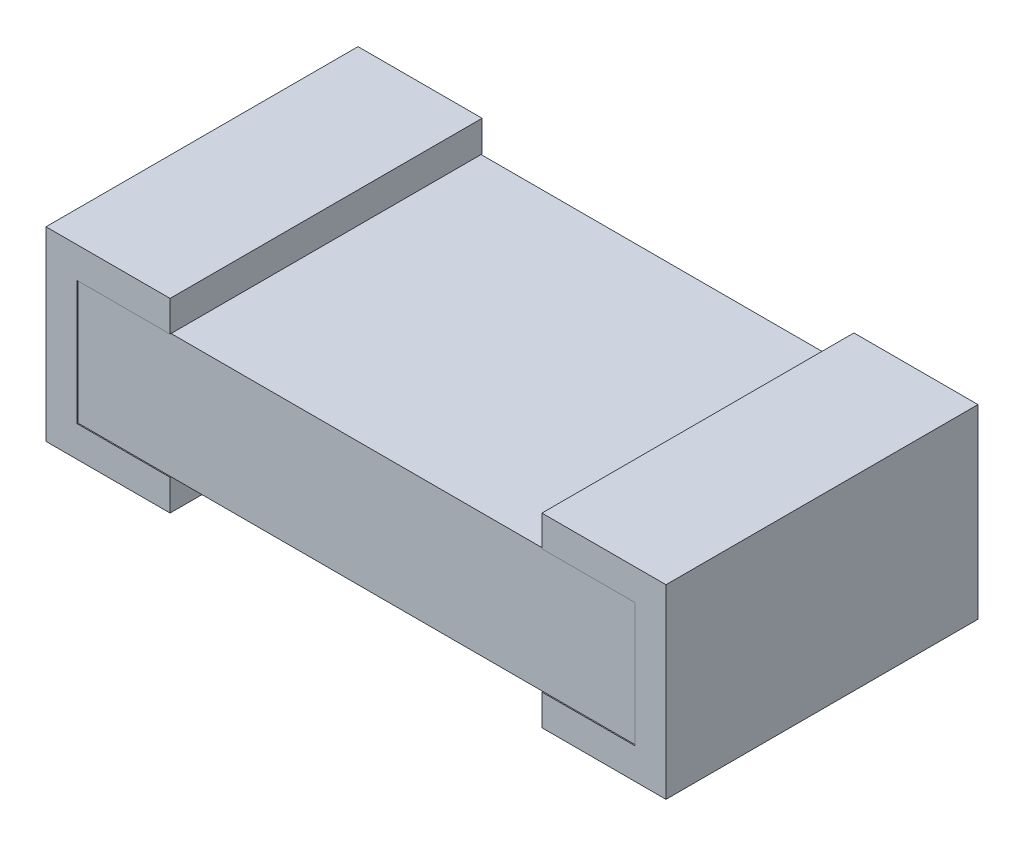
ISO-10303-21;
HEADER;
FILE_DESCRIPTION(('STEP AP214'),'2;1');
FILE_NAME('part.step','',(''),(''),'','','');
FILE_SCHEMA(('AUTOMOTIVE_DESIGN { 1 0 10303 214 1 1 1 1 }'));
ENDSEC;
DATA;
#1=APPLICATION_CONTEXT('core data for automotive mechanical design processes');
#2=APPLICATION_PROTOCOL_DEFINITION('international standard','automotive_design',2000,#1);
#3=PRODUCT_CONTEXT('',#1,'mechanical');
#4=PRODUCT('Part','Part','',(#3));
#5=PRODUCT_RELATED_PRODUCT_CATEGORY('part','',(#4));
#6=PRODUCT_DEFINITION_FORMATION('','',#4);
#7=PRODUCT_DEFINITION_CONTEXT('part definition',#1,'design');
#8=PRODUCT_DEFINITION('design','',#6,#7);
#9=PRODUCT_DEFINITION_SHAPE('','',#8);
#10=(LENGTH_UNIT() NAMED_UNIT(*) SI_UNIT(.MILLI.,.METRE.));
#11=(NAMED_UNIT(*) PLANE_ANGLE_UNIT() SI_UNIT($,.RADIAN.));
#12=(NAMED_UNIT(*) SI_UNIT($,.STERADIAN.) SOLID_ANGLE_UNIT());
#13=UNCERTAINTY_MEASURE_WITH_UNIT(LENGTH_MEASURE(1.E-05),#10,'distance_accuracy_value','');
#14=(GEOMETRIC_REPRESENTATION_CONTEXT(3) GLOBAL_UNCERTAINTY_ASSIGNED_CONTEXT((#13)) GLOBAL_UNIT_ASSIGNED_CONTEXT((#10,
#11,#12)) REPRESENTATION_CONTEXT('',''));
#15=CARTESIAN_POINT('',(0.,0.,0.));
#16=DIRECTION('',(0.,0.,1.));
#17=DIRECTION('',(1.,0.,0.));
#18=AXIS2_PLACEMENT_3D('',#15,#16,#17);
#19=CARTESIAN_POINT('',(-0.686,0.1525,0.381));
#20=DIRECTION('',(0.,-1.,0.));
#21=DIRECTION('',(0.,0.,-1.));
#22=AXIS2_PLACEMENT_3D('',#19,#20,#21);
#23=PLANE('',#22);
#24=DIRECTION('',(-1.,0.,0.));
#25=VECTOR('',#24,1.);
#26=CARTESIAN_POINT('',(-0.686,0.1525,0.381));
#27=LINE('',#26,#25);
#28=CARTESIAN_POINT('',(0.457,0.1525,0.381));
#29=VERTEX_POINT('',#28);
#30=CARTESIAN_POINT('',(-0.457,0.1525,0.381));
#31=VERTEX_POINT('',#30);
#32=EDGE_CURVE('E56',#29,#31,#27,.T.);
#33=ORIENTED_EDGE('',*,*,#32,.F.);
#34=DIRECTION('',(0.,0.,-1.));
#35=VECTOR('',#34,1.);
#36=CARTESIAN_POINT('',(0.457,0.1525,0.3835));
#37=LINE('',#36,#35);
#38=CARTESIAN_POINT('',(0.457,0.1525,-0.381));
#39=VERTEX_POINT('',#38);
#40=EDGE_CURVE('E203',#29,#39,#37,.T.);
#41=ORIENTED_EDGE('',*,*,#40,.T.);
#42=DIRECTION('',(-1.,0.,0.));
#43=VECTOR('',#42,1.);
#44=CARTESIAN_POINT('',(-0.686,0.1525,-0.381));
#45=LINE('',#44,#43);
#46=CARTESIAN_POINT('',(-0.457,0.1525,-0.381));
#47=VERTEX_POINT('',#46);
#48=EDGE_CURVE('E367',#39,#47,#45,.T.);
#49=ORIENTED_EDGE('',*,*,#48,.T.);
#50=DIRECTION('',(0.,0.,-1.));
#51=VECTOR('',#50,1.);
#52=CARTESIAN_POINT('',(-0.457,0.1525,0.3835));
#53=LINE('',#52,#51);
#54=EDGE_CURVE('E326',#31,#47,#53,.T.);
#55=ORIENTED_EDGE('',*,*,#54,.F.);
#56=EDGE_LOOP('',(#33,#41,#49,#55));
#57=FACE_BOUND('',#56,.T.);
#58=ADVANCED_FACE('F32',(#57),#23,.F.);
#59=CARTESIAN_POINT('',(-0.686,-0.1525,0.381));
#60=DIRECTION('',(0.,1.,0.));
#61=DIRECTION('',(0.,0.,1.));
#62=AXIS2_PLACEMENT_3D('',#59,#60,#61);
#63=PLANE('',#62);
#64=DIRECTION('',(1.,0.,0.));
#65=VECTOR('',#64,1.);
#66=CARTESIAN_POINT('',(-0.686,-0.1525,-0.381));
#67=LINE('',#66,#65);
#68=CARTESIAN_POINT('',(-0.457,-0.1525,-0.381));
#69=VERTEX_POINT('',#68);
#70=CARTESIAN_POINT('',(0.457,-0.1525,-0.381));
#71=VERTEX_POINT('',#70);
#72=EDGE_CURVE('E374',#69,#71,#67,.T.);
#73=ORIENTED_EDGE('',*,*,#72,.T.);
#74=DIRECTION('',(0.,0.,-1.));
#75=VECTOR('',#74,1.);
#76=CARTESIAN_POINT('',(0.457,-0.1525,0.3835));
#77=LINE('',#76,#75);
#78=CARTESIAN_POINT('',(0.457,-0.1525,0.381));
#79=VERTEX_POINT('',#78);
#80=EDGE_CURVE('E48',#79,#71,#77,.T.);
#81=ORIENTED_EDGE('',*,*,#80,.F.);
#82=DIRECTION('',(1.,0.,0.));
#83=VECTOR('',#82,1.);
#84=CARTESIAN_POINT('',(-0.686,-0.1525,0.381));
#85=LINE('',#84,#83);
#86=CARTESIAN_POINT('',(-0.457,-0.1525,0.381));
#87=VERTEX_POINT('',#86);
#88=EDGE_CURVE('E40',#87,#79,#85,.T.);
#89=ORIENTED_EDGE('',*,*,#88,.F.);
#90=DIRECTION('',(0.,0.,-1.));
#91=VECTOR('',#90,1.);
#92=CARTESIAN_POINT('',(-0.457,-0.1525,0.3835));
#93=LINE('',#92,#91);
#94=EDGE_CURVE('E339',#87,#69,#93,.T.);
#95=ORIENTED_EDGE('',*,*,#94,.T.);
#96=EDGE_LOOP('',(#73,#81,#89,#95));
#97=FACE_BOUND('',#96,.T.);
#98=ADVANCED_FACE('F390',(#97),#63,.F.);
#99=CARTESIAN_POINT('',(0.686,0.1525,0.381));
#100=DIRECTION('',(0.,0.,-1.));
#101=DIRECTION('',(-1.,0.,0.));
#102=AXIS2_PLACEMENT_3D('',#99,#100,#101);
#103=PLANE('',#102);
#104=DIRECTION('',(0.,1.,0.));
#105=VECTOR('',#104,1.);
#106=CARTESIAN_POINT('',(0.686,-0.1525,0.381));
#107=LINE('',#106,#105);
#108=CARTESIAN_POINT('',(0.686,-0.1525,0.381));
#109=VERTEX_POINT('',#108);
#110=CARTESIAN_POINT('',(0.686,0.1525,0.381));
#111=VERTEX_POINT('',#110);
#112=EDGE_CURVE('E355',#109,#111,#107,.T.);
#113=ORIENTED_EDGE('',*,*,#112,.T.);
#114=EDGE_CURVE('E357',#111,#29,#27,.T.);
#115=ORIENTED_EDGE('',*,*,#114,.T.);
#116=ORIENTED_EDGE('',*,*,#32,.T.);
#117=DIRECTION('',(1.,0.,0.));
#118=VECTOR('',#117,1.);
#119=CARTESIAN_POINT('',(0.686,0.1525,0.381));
#120=LINE('',#119,#118);
#121=CARTESIAN_POINT('',(-0.686,0.1525,0.381));
#122=VERTEX_POINT('',#121);
#123=EDGE_CURVE('E351',#122,#31,#120,.T.);
#124=ORIENTED_EDGE('',*,*,#123,.F.);
#125=DIRECTION('',(0.,-1.,0.));
#126=VECTOR('',#125,1.);
#127=CARTESIAN_POINT('',(-0.686,-0.1525,0.381));
#128=LINE('',#127,#126);
#129=CARTESIAN_POINT('',(-0.686,-0.1525,0.381));
#130=VERTEX_POINT('',#129);
#131=EDGE_CURVE('E359',#122,#130,#128,.T.);
#132=ORIENTED_EDGE('',*,*,#131,.T.);
#133=EDGE_CURVE('E11',#130,#87,#85,.T.);
#134=ORIENTED_EDGE('',*,*,#133,.T.);
#135=ORIENTED_EDGE('',*,*,#88,.T.);
#136=DIRECTION('',(1.,0.,0.));
#137=VECTOR('',#136,1.);
#138=CARTESIAN_POINT('',(0.686,-0.1525,0.381));
#139=LINE('',#138,#137);
#140=EDGE_CURVE('E207',#79,#109,#139,.T.);
#141=ORIENTED_EDGE('',*,*,#140,.T.);
#142=EDGE_LOOP('',(#113,#115,#116,#124,#132,#134,#135,#141));
#143=FACE_BOUND('',#142,.T.);
#144=ADVANCED_FACE('F417',(#143),#103,.F.);
#145=CARTESIAN_POINT('',(0.686,0.1525,-0.381));
#146=DIRECTION('',(0.,0.,-1.));
#147=DIRECTION('',(-1.,0.,0.));
#148=AXIS2_PLACEMENT_3D('',#145,#146,#147);
#149=PLANE('',#148);
#150=DIRECTION('',(0.,1.,0.));
#151=VECTOR('',#150,1.);
#152=CARTESIAN_POINT('',(0.686,-0.1525,-0.381));
#153=LINE('',#152,#151);
#154=CARTESIAN_POINT('',(0.686,-0.1525,-0.381));
#155=VERTEX_POINT('',#154);
#156=CARTESIAN_POINT('',(0.686,0.1525,-0.381));
#157=VERTEX_POINT('',#156);
#158=EDGE_CURVE('E354',#155,#157,#153,.T.);
#159=ORIENTED_EDGE('',*,*,#158,.F.);
#160=EDGE_CURVE('E369',#71,#155,#67,.T.);
#161=ORIENTED_EDGE('',*,*,#160,.F.);
#162=ORIENTED_EDGE('',*,*,#72,.F.);
#163=CARTESIAN_POINT('',(-0.686,-0.1525,-0.381));
#164=VERTEX_POINT('',#163);
#165=EDGE_CURVE('E35',#164,#69,#67,.T.);
#166=ORIENTED_EDGE('',*,*,#165,.F.);
#167=DIRECTION('',(0.,-1.,0.));
#168=VECTOR('',#167,1.);
#169=CARTESIAN_POINT('',(-0.686,-0.1525,-0.381));
#170=LINE('',#169,#168);
#171=CARTESIAN_POINT('',(-0.686,0.1525,-0.381));
#172=VERTEX_POINT('',#171);
#173=EDGE_CURVE('E366',#172,#164,#170,.T.);
#174=ORIENTED_EDGE('',*,*,#173,.F.);
#175=EDGE_CURVE('E363',#47,#172,#45,.T.);
#176=ORIENTED_EDGE('',*,*,#175,.F.);
#177=ORIENTED_EDGE('',*,*,#48,.F.);
#178=EDGE_CURVE('E364',#157,#39,#45,.T.);
#179=ORIENTED_EDGE('',*,*,#178,.F.);
#180=EDGE_LOOP('',(#159,#161,#162,#166,#174,#176,#177,#179));
#181=FACE_BOUND('',#180,.T.);
#182=ADVANCED_FACE('F391',(#181),#149,.T.);
#183=CARTESIAN_POINT('',(-0.686,-0.1525,0.3835));
#184=DIRECTION('',(0.,-1.,0.));
#185=DIRECTION('',(0.,0.,-1.));
#186=AXIS2_PLACEMENT_3D('',#183,#184,#185);
#187=PLANE('',#186);
#188=CARTESIAN_POINT('',(-0.457,-0.1525,0.3835));
#189=VERTEX_POINT('',#188);
#190=EDGE_CURVE('E335',#189,#87,#93,.T.);
#191=ORIENTED_EDGE('',*,*,#190,.T.);
#192=ORIENTED_EDGE('',*,*,#133,.F.);
#193=DIRECTION('',(0.,0.,-1.));
#194=VECTOR('',#193,1.);
#195=CARTESIAN_POINT('',(-0.686,-0.1525,0.3835));
#196=LINE('',#195,#194);
#197=CARTESIAN_POINT('',(-0.686,-0.1525,0.3835));
#198=VERTEX_POINT('',#197);
#199=EDGE_CURVE('E331',#198,#130,#196,.T.);
#200=ORIENTED_EDGE('',*,*,#199,.F.);
#201=DIRECTION('',(-1.,0.,0.));
#202=VECTOR('',#201,1.);
#203=CARTESIAN_POINT('',(-0.686,-0.1525,0.3835));
#204=LINE('',#203,#202);
#205=EDGE_CURVE('E296',#189,#198,#204,.T.);
#206=ORIENTED_EDGE('',*,*,#205,.F.);
#207=EDGE_LOOP('',(#191,#192,#200,#206));
#208=FACE_BOUND('',#207,.T.);
#209=ADVANCED_FACE('F422',(#208),#187,.F.);
#210=CARTESIAN_POINT('',(-0.686,0.1525,0.3835));
#211=DIRECTION('',(-1.,0.,0.));
#212=DIRECTION('',(0.,0.,1.));
#213=AXIS2_PLACEMENT_3D('',#210,#211,#212);
#214=PLANE('',#213);
#215=ORIENTED_EDGE('',*,*,#199,.T.);
#216=ORIENTED_EDGE('',*,*,#131,.F.);
#217=DIRECTION('',(0.,0.,-1.));
#218=VECTOR('',#217,1.);
#219=CARTESIAN_POINT('',(-0.686,0.1525,0.3835));
#220=LINE('',#219,#218);
#221=CARTESIAN_POINT('',(-0.686,0.1525,0.3835));
#222=VERTEX_POINT('',#221);
#223=EDGE_CURVE('E327',#222,#122,#220,.T.);
#224=ORIENTED_EDGE('',*,*,#223,.F.);
#225=DIRECTION('',(0.,1.,0.));
#226=VECTOR('',#225,1.);
#227=CARTESIAN_POINT('',(-0.686,0.1525,0.3835));
#228=LINE('',#227,#226);
#229=EDGE_CURVE('E298',#198,#222,#228,.T.);
#230=ORIENTED_EDGE('',*,*,#229,.F.);
#231=EDGE_LOOP('',(#215,#216,#224,#230));
#232=FACE_BOUND('',#231,.T.);
#233=ADVANCED_FACE('F426',(#232),#214,.F.);
#234=CARTESIAN_POINT('',(-0.457,0.1525,0.3835));
#235=DIRECTION('',(0.,1.,0.));
#236=DIRECTION('',(0.,0.,1.));
#237=AXIS2_PLACEMENT_3D('',#234,#235,#236);
#238=PLANE('',#237);
#239=ORIENTED_EDGE('',*,*,#223,.T.);
#240=ORIENTED_EDGE('',*,*,#123,.T.);
#241=CARTESIAN_POINT('',(-0.457,0.1525,0.3835));
#242=VERTEX_POINT('',#241);
#243=EDGE_CURVE('E322',#242,#31,#53,.T.);
#244=ORIENTED_EDGE('',*,*,#243,.F.);
#245=DIRECTION('',(1.,0.,0.));
#246=VECTOR('',#245,1.);
#247=CARTESIAN_POINT('',(-0.457,0.1525,0.3835));
#248=LINE('',#247,#246);
#249=EDGE_CURVE('E300',#222,#242,#248,.T.);
#250=ORIENTED_EDGE('',*,*,#249,.F.);
#251=EDGE_LOOP('',(#239,#240,#244,#250));
#252=FACE_BOUND('',#251,.T.);
#253=ADVANCED_FACE('F452',(#252),#238,.F.);
#254=CARTESIAN_POINT('',(-0.457,0.2285,0.3835));
#255=DIRECTION('',(-1.,0.,0.));
#256=DIRECTION('',(0.,-1.,0.));
#257=AXIS2_PLACEMENT_3D('',#254,#255,#256);
#258=PLANE('',#257);
#259=DIRECTION('',(0.,1.,0.));
#260=VECTOR('',#259,1.);
#261=CARTESIAN_POINT('',(-0.457,0.2285,-0.3835));
#262=LINE('',#261,#260);
#263=CARTESIAN_POINT('',(-0.457,0.1525,-0.3835));
#264=VERTEX_POINT('',#263);
#265=CARTESIAN_POINT('',(-0.457,0.2285,-0.3835));
#266=VERTEX_POINT('',#265);
#267=EDGE_CURVE('E283',#264,#266,#262,.T.);
#268=ORIENTED_EDGE('',*,*,#267,.T.);
#269=DIRECTION('',(0.,0.,-1.));
#270=VECTOR('',#269,1.);
#271=CARTESIAN_POINT('',(-0.457,0.2285,0.3835));
#272=LINE('',#271,#270);
#273=CARTESIAN_POINT('',(-0.457,0.2285,0.3835));
#274=VERTEX_POINT('',#273);
#275=EDGE_CURVE('E348',#274,#266,#272,.T.);
#276=ORIENTED_EDGE('',*,*,#275,.F.);
#277=DIRECTION('',(0.,1.,0.));
#278=VECTOR('',#277,1.);
#279=CARTESIAN_POINT('',(-0.457,0.2285,0.3835));
#280=LINE('',#279,#278);
#281=EDGE_CURVE('E284',#242,#274,#280,.T.);
#282=ORIENTED_EDGE('',*,*,#281,.F.);
#283=ORIENTED_EDGE('',*,*,#243,.T.);
#284=ORIENTED_EDGE('',*,*,#54,.T.);
#285=EDGE_CURVE('E302',#47,#264,#53,.T.);
#286=ORIENTED_EDGE('',*,*,#285,.T.);
#287=EDGE_LOOP('',(#268,#276,#282,#283,#284,#286));
#288=FACE_BOUND('',#287,.T.);
#289=ADVANCED_FACE('F454',(#288),#258,.F.);
#290=CARTESIAN_POINT('',(-0.762,0.2285,0.3835));
#291=DIRECTION('',(0.,-1.,0.));
#292=DIRECTION('',(0.,0.,-1.));
#293=AXIS2_PLACEMENT_3D('',#290,#291,#292);
#294=PLANE('',#293);
#295=DIRECTION('',(-1.,0.,0.));
#296=VECTOR('',#295,1.);
#297=CARTESIAN_POINT('',(-0.762,0.2285,-0.3835));
#298=LINE('',#297,#296);
#299=CARTESIAN_POINT('',(-0.762,0.2285,-0.3835));
#300=VERTEX_POINT('',#299);
#301=EDGE_CURVE('E305',#266,#300,#298,.T.);
#302=ORIENTED_EDGE('',*,*,#301,.T.);
#303=DIRECTION('',(0.,0.,-1.));
#304=VECTOR('',#303,1.);
#305=CARTESIAN_POINT('',(-0.762,0.2285,0.3835));
#306=LINE('',#305,#304);
#307=CARTESIAN_POINT('',(-0.762,0.2285,0.3835));
#308=VERTEX_POINT('',#307);
#309=EDGE_CURVE('E345',#308,#300,#306,.T.);
#310=ORIENTED_EDGE('',*,*,#309,.F.);
#311=DIRECTION('',(-1.,0.,0.));
#312=VECTOR('',#311,1.);
#313=CARTESIAN_POINT('',(-0.762,0.2285,0.3835));
#314=LINE('',#313,#312);
#315=EDGE_CURVE('E287',#274,#308,#314,.T.);
#316=ORIENTED_EDGE('',*,*,#315,.F.);
#317=ORIENTED_EDGE('',*,*,#275,.T.);
#318=EDGE_LOOP('',(#302,#310,#316,#317));
#319=FACE_BOUND('',#318,.T.);
#320=ADVANCED_FACE('F460',(#319),#294,.F.);
#321=CARTESIAN_POINT('',(-0.762,-0.2285,0.3835));
#322=DIRECTION('',(1.,0.,0.));
#323=DIRECTION('',(0.,0.,-1.));
#324=AXIS2_PLACEMENT_3D('',#321,#322,#323);
#325=PLANE('',#324);
#326=DIRECTION('',(0.,-1.,0.));
#327=VECTOR('',#326,1.);
#328=CARTESIAN_POINT('',(-0.762,-0.2285,-0.3835));
#329=LINE('',#328,#327);
#330=CARTESIAN_POINT('',(-0.762,-0.2285,-0.3835));
#331=VERTEX_POINT('',#330);
#332=EDGE_CURVE('E307',#300,#331,#329,.T.);
#333=ORIENTED_EDGE('',*,*,#332,.T.);
#334=DIRECTION('',(0.,0.,-1.));
#335=VECTOR('',#334,1.);
#336=CARTESIAN_POINT('',(-0.762,-0.2285,0.3835));
#337=LINE('',#336,#335);
#338=CARTESIAN_POINT('',(-0.762,-0.2285,0.3835));
#339=VERTEX_POINT('',#338);
#340=EDGE_CURVE('E342',#339,#331,#337,.T.);
#341=ORIENTED_EDGE('',*,*,#340,.F.);
#342=DIRECTION('',(0.,-1.,0.));
#343=VECTOR('',#342,1.);
#344=CARTESIAN_POINT('',(-0.762,-0.2285,0.3835));
#345=LINE('',#344,#343);
#346=EDGE_CURVE('E290',#308,#339,#345,.T.);
#347=ORIENTED_EDGE('',*,*,#346,.F.);
#348=ORIENTED_EDGE('',*,*,#309,.T.);
#349=EDGE_LOOP('',(#333,#341,#347,#348));
#350=FACE_BOUND('',#349,.T.);
#351=ADVANCED_FACE('F462',(#350),#325,.F.);
#352=CARTESIAN_POINT('',(-0.457,-0.2285,0.3835));
#353=DIRECTION('',(0.,1.,0.));
#354=DIRECTION('',(-1.,0.,0.));
#355=AXIS2_PLACEMENT_3D('',#352,#353,#354);
#356=PLANE('',#355);
#357=DIRECTION('',(1.,0.,0.));
#358=VECTOR('',#357,1.);
#359=CARTESIAN_POINT('',(-0.457,-0.2285,-0.3835));
#360=LINE('',#359,#358);
#361=CARTESIAN_POINT('',(-0.457,-0.2285,-0.3835));
#362=VERTEX_POINT('',#361);
#363=EDGE_CURVE('E309',#331,#362,#360,.T.);
#364=ORIENTED_EDGE('',*,*,#363,.T.);
#365=DIRECTION('',(0.,0.,-1.));
#366=VECTOR('',#365,1.);
#367=CARTESIAN_POINT('',(-0.457,-0.2285,0.3835));
#368=LINE('',#367,#366);
#369=CARTESIAN_POINT('',(-0.457,-0.2285,0.3835));
#370=VERTEX_POINT('',#369);
#371=EDGE_CURVE('E338',#370,#362,#368,.T.);
#372=ORIENTED_EDGE('',*,*,#371,.F.);
#373=DIRECTION('',(1.,0.,0.));
#374=VECTOR('',#373,1.);
#375=CARTESIAN_POINT('',(-0.457,-0.2285,0.3835));
#376=LINE('',#375,#374);
#377=EDGE_CURVE('E292',#339,#370,#376,.T.);
#378=ORIENTED_EDGE('',*,*,#377,.F.);
#379=ORIENTED_EDGE('',*,*,#340,.T.);
#380=EDGE_LOOP('',(#364,#372,#378,#379));
#381=FACE_BOUND('',#380,.T.);
#382=ADVANCED_FACE('F463',(#381),#356,.F.);
#383=CARTESIAN_POINT('',(-0.457,-0.1525,0.3835));
#384=DIRECTION('',(-1.,0.,0.));
#385=DIRECTION('',(0.,-1.,0.));
#386=AXIS2_PLACEMENT_3D('',#383,#384,#385);
#387=PLANE('',#386);
#388=DIRECTION('',(0.,1.,0.));
#389=VECTOR('',#388,1.);
#390=CARTESIAN_POINT('',(-0.457,-0.1525,-0.3835));
#391=LINE('',#390,#389);
#392=CARTESIAN_POINT('',(-0.457,-0.1525,-0.3835));
#393=VERTEX_POINT('',#392);
#394=EDGE_CURVE('E311',#362,#393,#391,.T.);
#395=ORIENTED_EDGE('',*,*,#394,.T.);
#396=EDGE_CURVE('E334',#69,#393,#93,.T.);
#397=ORIENTED_EDGE('',*,*,#396,.F.);
#398=ORIENTED_EDGE('',*,*,#94,.F.);
#399=ORIENTED_EDGE('',*,*,#190,.F.);
#400=DIRECTION('',(0.,1.,0.));
#401=VECTOR('',#400,1.);
#402=CARTESIAN_POINT('',(-0.457,-0.1525,0.3835));
#403=LINE('',#402,#401);
#404=EDGE_CURVE('E294',#370,#189,#403,.T.);
#405=ORIENTED_EDGE('',*,*,#404,.F.);
#406=ORIENTED_EDGE('',*,*,#371,.T.);
#407=EDGE_LOOP('',(#395,#397,#398,#399,#405,#406));
#408=FACE_BOUND('',#407,.T.);
#409=ADVANCED_FACE('F386',(#408),#387,.F.);
#410=ORIENTED_EDGE('',*,*,#165,.T.);
#411=ORIENTED_EDGE('',*,*,#396,.T.);
#412=DIRECTION('',(-1.,0.,0.));
#413=VECTOR('',#412,1.);
#414=CARTESIAN_POINT('',(-0.686,-0.1525,-0.3835));
#415=LINE('',#414,#413);
#416=CARTESIAN_POINT('',(-0.686,-0.1525,-0.3835));
#417=VERTEX_POINT('',#416);
#418=EDGE_CURVE('E314',#393,#417,#415,.T.);
#419=ORIENTED_EDGE('',*,*,#418,.T.);
#420=EDGE_CURVE('E330',#164,#417,#196,.T.);
#421=ORIENTED_EDGE('',*,*,#420,.F.);
#422=EDGE_LOOP('',(#410,#411,#419,#421));
#423=FACE_BOUND('',#422,.T.);
#424=ADVANCED_FACE('F381',(#423),#187,.F.);
#425=ORIENTED_EDGE('',*,*,#173,.T.);
#426=ORIENTED_EDGE('',*,*,#420,.T.);
#427=DIRECTION('',(0.,1.,0.));
#428=VECTOR('',#427,1.);
#429=CARTESIAN_POINT('',(-0.686,0.1525,-0.3835));
#430=LINE('',#429,#428);
#431=CARTESIAN_POINT('',(-0.686,0.1525,-0.3835));
#432=VERTEX_POINT('',#431);
#433=EDGE_CURVE('E317',#417,#432,#430,.T.);
#434=ORIENTED_EDGE('',*,*,#433,.T.);
#435=EDGE_CURVE('E325',#172,#432,#220,.T.);
#436=ORIENTED_EDGE('',*,*,#435,.F.);
#437=EDGE_LOOP('',(#425,#426,#434,#436));
#438=FACE_BOUND('',#437,.T.);
#439=ADVANCED_FACE('F443',(#438),#214,.F.);
#440=ORIENTED_EDGE('',*,*,#175,.T.);
#441=ORIENTED_EDGE('',*,*,#435,.T.);
#442=DIRECTION('',(1.,0.,0.));
#443=VECTOR('',#442,1.);
#444=CARTESIAN_POINT('',(-0.457,0.1525,-0.3835));
#445=LINE('',#444,#443);
#446=EDGE_CURVE('E288',#432,#264,#445,.T.);
#447=ORIENTED_EDGE('',*,*,#446,.T.);
#448=ORIENTED_EDGE('',*,*,#285,.F.);
#449=EDGE_LOOP('',(#440,#441,#447,#448));
#450=FACE_BOUND('',#449,.T.);
#451=ADVANCED_FACE('F446',(#450),#238,.F.);
#452=CARTESIAN_POINT('',(-0.457,0.1525,0.3835));
#453=DIRECTION('',(0.,0.,-1.));
#454=DIRECTION('',(-1.,0.,0.));
#455=AXIS2_PLACEMENT_3D('',#452,#453,#454);
#456=PLANE('',#455);
#457=ORIENTED_EDGE('',*,*,#281,.T.);
#458=ORIENTED_EDGE('',*,*,#315,.T.);
#459=ORIENTED_EDGE('',*,*,#346,.T.);
#460=ORIENTED_EDGE('',*,*,#377,.T.);
#461=ORIENTED_EDGE('',*,*,#404,.T.);
#462=ORIENTED_EDGE('',*,*,#205,.T.);
#463=ORIENTED_EDGE('',*,*,#229,.T.);
#464=ORIENTED_EDGE('',*,*,#249,.T.);
#465=EDGE_LOOP('',(#457,#458,#459,#460,#461,#462,#463,#464));
#466=FACE_BOUND('',#465,.T.);
#467=ADVANCED_FACE('F430',(#466),#456,.F.);
#468=CARTESIAN_POINT('',(-0.457,0.1525,-0.3835));
#469=DIRECTION('',(0.,0.,-1.));
#470=DIRECTION('',(-1.,0.,0.));
#471=AXIS2_PLACEMENT_3D('',#468,#469,#470);
#472=PLANE('',#471);
#473=ORIENTED_EDGE('',*,*,#267,.F.);
#474=ORIENTED_EDGE('',*,*,#446,.F.);
#475=ORIENTED_EDGE('',*,*,#433,.F.);
#476=ORIENTED_EDGE('',*,*,#418,.F.);
#477=ORIENTED_EDGE('',*,*,#394,.F.);
#478=ORIENTED_EDGE('',*,*,#363,.F.);
#479=ORIENTED_EDGE('',*,*,#332,.F.);
#480=ORIENTED_EDGE('',*,*,#301,.F.);
#481=EDGE_LOOP('',(#473,#474,#475,#476,#477,#478,#479,#480));
#482=FACE_BOUND('',#481,.T.);
#483=ADVANCED_FACE('F439',(#482),#472,.T.);
#484=CARTESIAN_POINT('',(0.457,0.1525,0.3835));
#485=DIRECTION('',(0.,-1.,0.));
#486=DIRECTION('',(0.,0.,-1.));
#487=AXIS2_PLACEMENT_3D('',#484,#485,#486);
#488=PLANE('',#487);
#489=ORIENTED_EDGE('',*,*,#114,.F.);
#490=DIRECTION('',(0.,0.,-1.));
#491=VECTOR('',#490,1.);
#492=CARTESIAN_POINT('',(0.686,0.1525,0.3835));
#493=LINE('',#492,#491);
#494=CARTESIAN_POINT('',(0.686,0.1525,0.3835));
#495=VERTEX_POINT('',#494);
#496=EDGE_CURVE('E223',#495,#111,#493,.T.);
#497=ORIENTED_EDGE('',*,*,#496,.F.);
#498=DIRECTION('',(-1.,0.,0.));
#499=VECTOR('',#498,1.);
#500=CARTESIAN_POINT('',(0.457,0.1525,0.3835));
#501=LINE('',#500,#499);
#502=CARTESIAN_POINT('',(0.457,0.1525,0.3835));
#503=VERTEX_POINT('',#502);
#504=EDGE_CURVE('E214',#495,#503,#501,.T.);
#505=ORIENTED_EDGE('',*,*,#504,.T.);
#506=EDGE_CURVE('E196',#503,#29,#37,.T.);
#507=ORIENTED_EDGE('',*,*,#506,.T.);
#508=EDGE_LOOP('',(#489,#497,#505,#507));
#509=FACE_BOUND('',#508,.T.);
#510=ADVANCED_FACE('F221',(#509),#488,.T.);
#511=CARTESIAN_POINT('',(0.686,0.1525,0.3835));
#512=DIRECTION('',(-1.,0.,0.));
#513=DIRECTION('',(0.,0.,1.));
#514=AXIS2_PLACEMENT_3D('',#511,#512,#513);
#515=PLANE('',#514);
#516=ORIENTED_EDGE('',*,*,#112,.F.);
#517=DIRECTION('',(0.,0.,-1.));
#518=VECTOR('',#517,1.);
#519=CARTESIAN_POINT('',(0.686,-0.1525,0.3835));
#520=LINE('',#519,#518);
#521=CARTESIAN_POINT('',(0.686,-0.1525,0.3835));
#522=VERTEX_POINT('',#521);
#523=EDGE_CURVE('E277',#522,#109,#520,.T.);
#524=ORIENTED_EDGE('',*,*,#523,.F.);
#525=DIRECTION('',(0.,1.,0.));
#526=VECTOR('',#525,1.);
#527=CARTESIAN_POINT('',(0.686,0.1525,0.3835));
#528=LINE('',#527,#526);
#529=EDGE_CURVE('E224',#522,#495,#528,.T.);
#530=ORIENTED_EDGE('',*,*,#529,.T.);
#531=ORIENTED_EDGE('',*,*,#496,.T.);
#532=EDGE_LOOP('',(#516,#524,#530,#531));
#533=FACE_BOUND('',#532,.T.);
#534=ADVANCED_FACE('F415',(#533),#515,.T.);
#535=CARTESIAN_POINT('',(0.686,-0.1525,0.3835));
#536=DIRECTION('',(0.,1.,0.));
#537=DIRECTION('',(0.,0.,1.));
#538=AXIS2_PLACEMENT_3D('',#535,#536,#537);
#539=PLANE('',#538);
#540=ORIENTED_EDGE('',*,*,#140,.F.);
#541=CARTESIAN_POINT('',(0.457,-0.1525,0.3835));
#542=VERTEX_POINT('',#541);
#543=EDGE_CURVE('E273',#542,#79,#77,.T.);
#544=ORIENTED_EDGE('',*,*,#543,.F.);
#545=DIRECTION('',(1.,0.,0.));
#546=VECTOR('',#545,1.);
#547=CARTESIAN_POINT('',(0.686,-0.1525,0.3835));
#548=LINE('',#547,#546);
#549=EDGE_CURVE('E226',#542,#522,#548,.T.);
#550=ORIENTED_EDGE('',*,*,#549,.T.);
#551=ORIENTED_EDGE('',*,*,#523,.T.);
#552=EDGE_LOOP('',(#540,#544,#550,#551));
#553=FACE_BOUND('',#552,.T.);
#554=ADVANCED_FACE('F411',(#553),#539,.T.);
#555=CARTESIAN_POINT('',(0.457,0.2285,0.3835));
#556=DIRECTION('',(-1.,0.,0.));
#557=DIRECTION('',(0.,-1.,0.));
#558=AXIS2_PLACEMENT_3D('',#555,#556,#557);
#559=PLANE('',#558);
#560=DIRECTION('',(0.,1.,0.));
#561=VECTOR('',#560,1.);
#562=CARTESIAN_POINT('',(0.457,0.2285,-0.3835));
#563=LINE('',#562,#561);
#564=CARTESIAN_POINT('',(0.457,0.1525,-0.3835));
#565=VERTEX_POINT('',#564);
#566=CARTESIAN_POINT('',(0.457,0.2285,-0.3835));
#567=VERTEX_POINT('',#566);
#568=EDGE_CURVE('E242',#565,#567,#563,.T.);
#569=ORIENTED_EDGE('',*,*,#568,.F.);
#570=EDGE_CURVE('E209',#39,#565,#37,.T.);
#571=ORIENTED_EDGE('',*,*,#570,.F.);
#572=ORIENTED_EDGE('',*,*,#40,.F.);
#573=ORIENTED_EDGE('',*,*,#506,.F.);
#574=DIRECTION('',(0.,1.,0.));
#575=VECTOR('',#574,1.);
#576=CARTESIAN_POINT('',(0.457,0.2285,0.3835));
#577=LINE('',#576,#575);
#578=CARTESIAN_POINT('',(0.457,0.2285,0.3835));
#579=VERTEX_POINT('',#578);
#580=EDGE_CURVE('E200',#503,#579,#577,.T.);
#581=ORIENTED_EDGE('',*,*,#580,.T.);
#582=DIRECTION('',(0.,0.,-1.));
#583=VECTOR('',#582,1.);
#584=CARTESIAN_POINT('',(0.457,0.2285,0.3835));
#585=LINE('',#584,#583);
#586=EDGE_CURVE('E241',#579,#567,#585,.T.);
#587=ORIENTED_EDGE('',*,*,#586,.T.);
#588=EDGE_LOOP('',(#569,#571,#572,#573,#581,#587));
#589=FACE_BOUND('',#588,.T.);
#590=ADVANCED_FACE('F199',(#589),#559,.T.);
#591=CARTESIAN_POINT('',(0.686,0.1525,-0.3835));
#592=VERTEX_POINT('',#591);
#593=EDGE_CURVE('E280',#157,#592,#493,.T.);
#594=ORIENTED_EDGE('',*,*,#593,.F.);
#595=ORIENTED_EDGE('',*,*,#178,.T.);
#596=ORIENTED_EDGE('',*,*,#570,.T.);
#597=DIRECTION('',(-1.,0.,0.));
#598=VECTOR('',#597,1.);
#599=CARTESIAN_POINT('',(0.457,0.1525,-0.3835));
#600=LINE('',#599,#598);
#601=EDGE_CURVE('E245',#592,#565,#600,.T.);
#602=ORIENTED_EDGE('',*,*,#601,.F.);
#603=EDGE_LOOP('',(#594,#595,#596,#602));
#604=FACE_BOUND('',#603,.T.);
#605=ADVANCED_FACE('F399',(#604),#488,.T.);
#606=CARTESIAN_POINT('',(0.686,-0.1525,-0.3835));
#607=VERTEX_POINT('',#606);
#608=EDGE_CURVE('E276',#155,#607,#520,.T.);
#609=ORIENTED_EDGE('',*,*,#608,.F.);
#610=ORIENTED_EDGE('',*,*,#158,.T.);
#611=ORIENTED_EDGE('',*,*,#593,.T.);
#612=DIRECTION('',(0.,1.,0.));
#613=VECTOR('',#612,1.);
#614=CARTESIAN_POINT('',(0.686,0.1525,-0.3835));
#615=LINE('',#614,#613);
#616=EDGE_CURVE('E248',#607,#592,#615,.T.);
#617=ORIENTED_EDGE('',*,*,#616,.F.);
#618=EDGE_LOOP('',(#609,#610,#611,#617));
#619=FACE_BOUND('',#618,.T.);
#620=ADVANCED_FACE('F395',(#619),#515,.T.);
#621=CARTESIAN_POINT('',(0.457,-0.1525,-0.3835));
#622=VERTEX_POINT('',#621);
#623=EDGE_CURVE('E272',#71,#622,#77,.T.);
#624=ORIENTED_EDGE('',*,*,#623,.F.);
#625=ORIENTED_EDGE('',*,*,#160,.T.);
#626=ORIENTED_EDGE('',*,*,#608,.T.);
#627=DIRECTION('',(1.,0.,0.));
#628=VECTOR('',#627,1.);
#629=CARTESIAN_POINT('',(0.686,-0.1525,-0.3835));
#630=LINE('',#629,#628);
#631=EDGE_CURVE('E251',#622,#607,#630,.T.);
#632=ORIENTED_EDGE('',*,*,#631,.F.);
#633=EDGE_LOOP('',(#624,#625,#626,#632));
#634=FACE_BOUND('',#633,.T.);
#635=ADVANCED_FACE('F404',(#634),#539,.T.);
#636=CARTESIAN_POINT('',(0.457,-0.1525,0.3835));
#637=DIRECTION('',(-1.,0.,0.));
#638=DIRECTION('',(0.,-1.,0.));
#639=AXIS2_PLACEMENT_3D('',#636,#637,#638);
#640=PLANE('',#639);
#641=DIRECTION('',(0.,1.,0.));
#642=VECTOR('',#641,1.);
#643=CARTESIAN_POINT('',(0.457,-0.1525,-0.3835));
#644=LINE('',#643,#642);
#645=CARTESIAN_POINT('',(0.457,-0.2285,-0.3835));
#646=VERTEX_POINT('',#645);
#647=EDGE_CURVE('E254',#646,#622,#644,.T.);
#648=ORIENTED_EDGE('',*,*,#647,.F.);
#649=DIRECTION('',(0.,0.,-1.));
#650=VECTOR('',#649,1.);
#651=CARTESIAN_POINT('',(0.457,-0.2285,0.3835));
#652=LINE('',#651,#650);
#653=CARTESIAN_POINT('',(0.457,-0.2285,0.3835));
#654=VERTEX_POINT('',#653);
#655=EDGE_CURVE('E270',#654,#646,#652,.T.);
#656=ORIENTED_EDGE('',*,*,#655,.F.);
#657=DIRECTION('',(0.,1.,0.));
#658=VECTOR('',#657,1.);
#659=CARTESIAN_POINT('',(0.457,-0.1525,0.3835));
#660=LINE('',#659,#658);
#661=EDGE_CURVE('E231',#654,#542,#660,.T.);
#662=ORIENTED_EDGE('',*,*,#661,.T.);
#663=ORIENTED_EDGE('',*,*,#543,.T.);
#664=ORIENTED_EDGE('',*,*,#80,.T.);
#665=ORIENTED_EDGE('',*,*,#623,.T.);
#666=EDGE_LOOP('',(#648,#656,#662,#663,#664,#665));
#667=FACE_BOUND('',#666,.T.);
#668=ADVANCED_FACE('F406',(#667),#640,.T.);
#669=CARTESIAN_POINT('',(0.457,-0.2285,0.3835));
#670=DIRECTION('',(0.,-1.,0.));
#671=DIRECTION('',(1.,0.,0.));
#672=AXIS2_PLACEMENT_3D('',#669,#670,#671);
#673=PLANE('',#672);
#674=DIRECTION('',(-1.,0.,0.));
#675=VECTOR('',#674,1.);
#676=CARTESIAN_POINT('',(0.457,-0.2285,-0.3835));
#677=LINE('',#676,#675);
#678=CARTESIAN_POINT('',(0.762,-0.2285,-0.3835));
#679=VERTEX_POINT('',#678);
#680=EDGE_CURVE('E257',#679,#646,#677,.T.);
#681=ORIENTED_EDGE('',*,*,#680,.F.);
#682=DIRECTION('',(0.,0.,-1.));
#683=VECTOR('',#682,1.);
#684=CARTESIAN_POINT('',(0.762,-0.2285,0.3835));
#685=LINE('',#684,#683);
#686=CARTESIAN_POINT('',(0.762,-0.2285,0.3835));
#687=VERTEX_POINT('',#686);
#688=EDGE_CURVE('E268',#687,#679,#685,.T.);
#689=ORIENTED_EDGE('',*,*,#688,.F.);
#690=DIRECTION('',(-1.,0.,0.));
#691=VECTOR('',#690,1.);
#692=CARTESIAN_POINT('',(0.457,-0.2285,0.3835));
#693=LINE('',#692,#691);
#694=EDGE_CURVE('E234',#687,#654,#693,.T.);
#695=ORIENTED_EDGE('',*,*,#694,.T.);
#696=ORIENTED_EDGE('',*,*,#655,.T.);
#697=EDGE_LOOP('',(#681,#689,#695,#696));
#698=FACE_BOUND('',#697,.T.);
#699=ADVANCED_FACE('F629',(#698),#673,.T.);
#700=CARTESIAN_POINT('',(0.762,-0.2285,0.3835));
#701=DIRECTION('',(1.,0.,0.));
#702=DIRECTION('',(0.,0.,-1.));
#703=AXIS2_PLACEMENT_3D('',#700,#701,#702);
#704=PLANE('',#703);
#705=DIRECTION('',(0.,-1.,0.));
#706=VECTOR('',#705,1.);
#707=CARTESIAN_POINT('',(0.762,-0.2285,-0.3835));
#708=LINE('',#707,#706);
#709=CARTESIAN_POINT('',(0.762,0.2285,-0.3835));
#710=VERTEX_POINT('',#709);
#711=EDGE_CURVE('E260',#710,#679,#708,.T.);
#712=ORIENTED_EDGE('',*,*,#711,.F.);
#713=DIRECTION('',(0.,0.,-1.));
#714=VECTOR('',#713,1.);
#715=CARTESIAN_POINT('',(0.762,0.2285,0.3835));
#716=LINE('',#715,#714);
#717=CARTESIAN_POINT('',(0.762,0.2285,0.3835));
#718=VERTEX_POINT('',#717);
#719=EDGE_CURVE('E266',#718,#710,#716,.T.);
#720=ORIENTED_EDGE('',*,*,#719,.F.);
#721=DIRECTION('',(0.,-1.,0.));
#722=VECTOR('',#721,1.);
#723=CARTESIAN_POINT('',(0.762,-0.2285,0.3835));
#724=LINE('',#723,#722);
#725=EDGE_CURVE('E237',#718,#687,#724,.T.);
#726=ORIENTED_EDGE('',*,*,#725,.T.);
#727=ORIENTED_EDGE('',*,*,#688,.T.);
#728=EDGE_LOOP('',(#712,#720,#726,#727));
#729=FACE_BOUND('',#728,.T.);
#730=ADVANCED_FACE('F638',(#729),#704,.T.);
#731=CARTESIAN_POINT('',(0.762,0.2285,0.3835));
#732=DIRECTION('',(0.,1.,0.));
#733=DIRECTION('',(0.,0.,1.));
#734=AXIS2_PLACEMENT_3D('',#731,#732,#733);
#735=PLANE('',#734);
#736=DIRECTION('',(1.,0.,0.));
#737=VECTOR('',#736,1.);
#738=CARTESIAN_POINT('',(0.762,0.2285,-0.3835));
#739=LINE('',#738,#737);
#740=EDGE_CURVE('E219',#567,#710,#739,.T.);
#741=ORIENTED_EDGE('',*,*,#740,.F.);
#742=ORIENTED_EDGE('',*,*,#586,.F.);
#743=DIRECTION('',(1.,0.,0.));
#744=VECTOR('',#743,1.);
#745=CARTESIAN_POINT('',(0.762,0.2285,0.3835));
#746=LINE('',#745,#744);
#747=EDGE_CURVE('E218',#579,#718,#746,.T.);
#748=ORIENTED_EDGE('',*,*,#747,.T.);
#749=ORIENTED_EDGE('',*,*,#719,.T.);
#750=EDGE_LOOP('',(#741,#742,#748,#749));
#751=FACE_BOUND('',#750,.T.);
#752=ADVANCED_FACE('F648',(#751),#735,.T.);
#753=CARTESIAN_POINT('',(0.457,0.1525,0.3835));
#754=DIRECTION('',(0.,0.,-1.));
#755=DIRECTION('',(1.,0.,0.));
#756=AXIS2_PLACEMENT_3D('',#753,#754,#755);
#757=PLANE('',#756);
#758=ORIENTED_EDGE('',*,*,#580,.F.);
#759=ORIENTED_EDGE('',*,*,#504,.F.);
#760=ORIENTED_EDGE('',*,*,#529,.F.);
#761=ORIENTED_EDGE('',*,*,#549,.F.);
#762=ORIENTED_EDGE('',*,*,#661,.F.);
#763=ORIENTED_EDGE('',*,*,#694,.F.);
#764=ORIENTED_EDGE('',*,*,#725,.F.);
#765=ORIENTED_EDGE('',*,*,#747,.F.);
#766=EDGE_LOOP('',(#758,#759,#760,#761,#762,#763,#764,#765));
#767=FACE_BOUND('',#766,.T.);
#768=ADVANCED_FACE('F212',(#767),#757,.F.);
#769=CARTESIAN_POINT('',(0.457,0.1525,-0.3835));
#770=DIRECTION('',(0.,0.,-1.));
#771=DIRECTION('',(1.,0.,0.));
#772=AXIS2_PLACEMENT_3D('',#769,#770,#771);
#773=PLANE('',#772);
#774=ORIENTED_EDGE('',*,*,#568,.T.);
#775=ORIENTED_EDGE('',*,*,#740,.T.);
#776=ORIENTED_EDGE('',*,*,#711,.T.);
#777=ORIENTED_EDGE('',*,*,#680,.T.);
#778=ORIENTED_EDGE('',*,*,#647,.T.);
#779=ORIENTED_EDGE('',*,*,#631,.T.);
#780=ORIENTED_EDGE('',*,*,#616,.T.);
#781=ORIENTED_EDGE('',*,*,#601,.T.);
#782=EDGE_LOOP('',(#774,#775,#776,#777,#778,#779,#780,#781));
#783=FACE_BOUND('',#782,.T.);
#784=ADVANCED_FACE('F401',(#783),#773,.T.);
#785=CLOSED_SHELL('',(#58,#98,#144,#182,#209,#233,#253,#289,#320,#351,#382,#409,#424,#439,#451,
#467,#483,#510,#534,#554,#590,#605,#620,#635,#668,#699,#730,#752,#768,#784));
#786=MANIFOLD_SOLID_BREP('B2',#785);
#787=ADVANCED_BREP_SHAPE_REPRESENTATION('',(#18,#786),#14);
#788=SHAPE_DEFINITION_REPRESENTATION(#9,#787);
ENDSEC;
END-ISO-10303-21;
